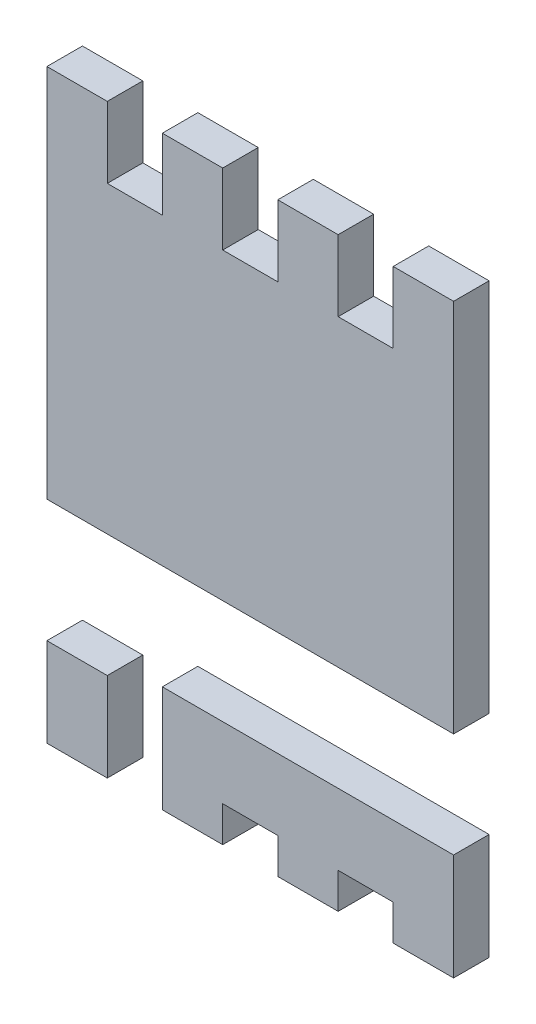
ISO-10303-21;
HEADER;
FILE_DESCRIPTION(('STEP AP214'),'2;1');
FILE_NAME('part.step','',(''),(''),'','','');
FILE_SCHEMA(('AUTOMOTIVE_DESIGN { 1 0 10303 214 1 1 1 1 }'));
ENDSEC;
DATA;
#1=APPLICATION_CONTEXT('core data for automotive mechanical design processes');
#2=APPLICATION_PROTOCOL_DEFINITION('international standard','automotive_design',2000,#1);
#3=PRODUCT_CONTEXT('',#1,'mechanical');
#4=PRODUCT('Part','Part','',(#3));
#5=PRODUCT_RELATED_PRODUCT_CATEGORY('part','',(#4));
#6=PRODUCT_DEFINITION_FORMATION('','',#4);
#7=PRODUCT_DEFINITION_CONTEXT('part definition',#1,'design');
#8=PRODUCT_DEFINITION('design','',#6,#7);
#9=PRODUCT_DEFINITION_SHAPE('','',#8);
#10=(LENGTH_UNIT() NAMED_UNIT(*) SI_UNIT(.MILLI.,.METRE.));
#11=(NAMED_UNIT(*) PLANE_ANGLE_UNIT() SI_UNIT($,.RADIAN.));
#12=(NAMED_UNIT(*) SI_UNIT($,.STERADIAN.) SOLID_ANGLE_UNIT());
#13=UNCERTAINTY_MEASURE_WITH_UNIT(LENGTH_MEASURE(1.E-05),#10,'distance_accuracy_value','');
#14=(GEOMETRIC_REPRESENTATION_CONTEXT(3) GLOBAL_UNCERTAINTY_ASSIGNED_CONTEXT((#13)) GLOBAL_UNIT_ASSIGNED_CONTEXT((#10,
#11,#12)) REPRESENTATION_CONTEXT('',''));
#15=CARTESIAN_POINT('',(0.,0.,0.));
#16=DIRECTION('',(0.,0.,1.));
#17=DIRECTION('',(1.,0.,0.));
#18=AXIS2_PLACEMENT_3D('',#15,#16,#17);
#19=CARTESIAN_POINT('',(-1.145,-1.65,0.2));
#20=DIRECTION('',(0.,1.,0.));
#21=DIRECTION('',(0.,0.,1.));
#22=AXIS2_PLACEMENT_3D('',#19,#20,#21);
#23=PLANE('',#22);
#24=DIRECTION('',(1.,0.,0.));
#25=VECTOR('',#24,1.);
#26=CARTESIAN_POINT('',(-1.145,-1.65,0.));
#27=LINE('',#26,#25);
#28=CARTESIAN_POINT('',(-1.145,-1.65,0.));
#29=VERTEX_POINT('',#28);
#30=CARTESIAN_POINT('',(-0.805,-1.65,0.));
#31=VERTEX_POINT('',#30);
#32=EDGE_CURVE('E112',#29,#31,#27,.T.);
#33=ORIENTED_EDGE('',*,*,#32,.T.);
#34=DIRECTION('',(0.,0.,-1.));
#35=VECTOR('',#34,1.);
#36=CARTESIAN_POINT('',(-0.805,-1.65,0.2));
#37=LINE('',#36,#35);
#38=CARTESIAN_POINT('',(-0.805,-1.65,0.2));
#39=VERTEX_POINT('',#38);
#40=EDGE_CURVE('E12',#39,#31,#37,.T.);
#41=ORIENTED_EDGE('',*,*,#40,.F.);
#42=DIRECTION('',(1.,0.,0.));
#43=VECTOR('',#42,1.);
#44=CARTESIAN_POINT('',(-1.145,-1.65,0.2));
#45=LINE('',#44,#43);
#46=CARTESIAN_POINT('',(-1.145,-1.65,0.2));
#47=VERTEX_POINT('',#46);
#48=EDGE_CURVE('E100',#47,#39,#45,.T.);
#49=ORIENTED_EDGE('',*,*,#48,.F.);
#50=DIRECTION('',(0.,0.,-1.));
#51=VECTOR('',#50,1.);
#52=CARTESIAN_POINT('',(-1.145,-1.65,0.2));
#53=LINE('',#52,#51);
#54=EDGE_CURVE('E108',#47,#29,#53,.T.);
#55=ORIENTED_EDGE('',*,*,#54,.T.);
#56=EDGE_LOOP('',(#33,#41,#49,#55));
#57=FACE_BOUND('',#56,.T.);
#58=ADVANCED_FACE('F49',(#57),#23,.F.);
#59=CARTESIAN_POINT('',(-0.805,-1.65,0.2));
#60=DIRECTION('',(-1.,0.,0.));
#61=DIRECTION('',(0.,0.,1.));
#62=AXIS2_PLACEMENT_3D('',#59,#60,#61);
#63=PLANE('',#62);
#64=DIRECTION('',(0.,1.,0.));
#65=VECTOR('',#64,1.);
#66=CARTESIAN_POINT('',(-0.805,-1.65,0.));
#67=LINE('',#66,#65);
#68=CARTESIAN_POINT('',(-0.805,-1.15,0.));
#69=VERTEX_POINT('',#68);
#70=EDGE_CURVE('E104',#31,#69,#67,.T.);
#71=ORIENTED_EDGE('',*,*,#70,.T.);
#72=DIRECTION('',(0.,0.,-1.));
#73=VECTOR('',#72,1.);
#74=CARTESIAN_POINT('',(-0.805,-1.15,0.2));
#75=LINE('',#74,#73);
#76=CARTESIAN_POINT('',(-0.805,-1.15,0.2));
#77=VERTEX_POINT('',#76);
#78=EDGE_CURVE('E57',#77,#69,#75,.T.);
#79=ORIENTED_EDGE('',*,*,#78,.F.);
#80=DIRECTION('',(0.,1.,0.));
#81=VECTOR('',#80,1.);
#82=CARTESIAN_POINT('',(-0.805,-1.65,0.2));
#83=LINE('',#82,#81);
#84=EDGE_CURVE('E95',#39,#77,#83,.T.);
#85=ORIENTED_EDGE('',*,*,#84,.F.);
#86=ORIENTED_EDGE('',*,*,#40,.T.);
#87=EDGE_LOOP('',(#71,#79,#85,#86));
#88=FACE_BOUND('',#87,.T.);
#89=ADVANCED_FACE('F103',(#88),#63,.F.);
#90=CARTESIAN_POINT('',(-0.805,-1.15,0.2));
#91=DIRECTION('',(0.,-1.,0.));
#92=DIRECTION('',(1.,0.,0.));
#93=AXIS2_PLACEMENT_3D('',#90,#91,#92);
#94=PLANE('',#93);
#95=DIRECTION('',(-1.,0.,0.));
#96=VECTOR('',#95,1.);
#97=CARTESIAN_POINT('',(-0.805,-1.15,0.));
#98=LINE('',#97,#96);
#99=CARTESIAN_POINT('',(-1.145,-1.15,0.));
#100=VERTEX_POINT('',#99);
#101=EDGE_CURVE('E82',#69,#100,#98,.T.);
#102=ORIENTED_EDGE('',*,*,#101,.T.);
#103=DIRECTION('',(0.,0.,-1.));
#104=VECTOR('',#103,1.);
#105=CARTESIAN_POINT('',(-1.145,-1.15,0.2));
#106=LINE('',#105,#104);
#107=CARTESIAN_POINT('',(-1.145,-1.15,0.2));
#108=VERTEX_POINT('',#107);
#109=EDGE_CURVE('E105',#108,#100,#106,.T.);
#110=ORIENTED_EDGE('',*,*,#109,.F.);
#111=DIRECTION('',(-1.,0.,0.));
#112=VECTOR('',#111,1.);
#113=CARTESIAN_POINT('',(-0.805,-1.15,0.2));
#114=LINE('',#113,#112);
#115=EDGE_CURVE('E98',#77,#108,#114,.T.);
#116=ORIENTED_EDGE('',*,*,#115,.F.);
#117=ORIENTED_EDGE('',*,*,#78,.T.);
#118=EDGE_LOOP('',(#102,#110,#116,#117));
#119=FACE_BOUND('',#118,.T.);
#120=ADVANCED_FACE('F106',(#119),#94,.F.);
#121=CARTESIAN_POINT('',(-1.145,-1.15,0.2));
#122=DIRECTION('',(1.,0.,0.));
#123=DIRECTION('',(0.,1.,0.));
#124=AXIS2_PLACEMENT_3D('',#121,#122,#123);
#125=PLANE('',#124);
#126=DIRECTION('',(0.,-1.,0.));
#127=VECTOR('',#126,1.);
#128=CARTESIAN_POINT('',(-1.145,-1.15,0.));
#129=LINE('',#128,#127);
#130=EDGE_CURVE('E88',#100,#29,#129,.T.);
#131=ORIENTED_EDGE('',*,*,#130,.T.);
#132=ORIENTED_EDGE('',*,*,#54,.F.);
#133=DIRECTION('',(0.,-1.,0.));
#134=VECTOR('',#133,1.);
#135=CARTESIAN_POINT('',(-1.145,-1.15,0.2));
#136=LINE('',#135,#134);
#137=EDGE_CURVE('E65',#108,#47,#136,.T.);
#138=ORIENTED_EDGE('',*,*,#137,.F.);
#139=ORIENTED_EDGE('',*,*,#109,.T.);
#140=EDGE_LOOP('',(#131,#132,#138,#139));
#141=FACE_BOUND('',#140,.T.);
#142=ADVANCED_FACE('F119',(#141),#125,.F.);
#143=CARTESIAN_POINT('',(0.,0.,0.2));
#144=DIRECTION('',(0.,0.,1.));
#145=DIRECTION('',(1.,0.,0.));
#146=AXIS2_PLACEMENT_3D('',#143,#144,#145);
#147=PLANE('',#146);
#148=ORIENTED_EDGE('',*,*,#48,.T.);
#149=ORIENTED_EDGE('',*,*,#84,.T.);
#150=ORIENTED_EDGE('',*,*,#115,.T.);
#151=ORIENTED_EDGE('',*,*,#137,.T.);
#152=EDGE_LOOP('',(#148,#149,#150,#151));
#153=FACE_BOUND('',#152,.T.);
#154=ADVANCED_FACE('F96',(#153),#147,.T.);
#155=CARTESIAN_POINT('',(0.,0.,0.));
#156=DIRECTION('',(0.,0.,1.));
#157=DIRECTION('',(1.,0.,0.));
#158=AXIS2_PLACEMENT_3D('',#155,#156,#157);
#159=PLANE('',#158);
#160=ORIENTED_EDGE('',*,*,#32,.F.);
#161=ORIENTED_EDGE('',*,*,#130,.F.);
#162=ORIENTED_EDGE('',*,*,#101,.F.);
#163=ORIENTED_EDGE('',*,*,#70,.F.);
#164=EDGE_LOOP('',(#160,#161,#162,#163));
#165=FACE_BOUND('',#164,.T.);
#166=ADVANCED_FACE('F122',(#165),#159,.F.);
#167=CLOSED_SHELL('',(#58,#89,#120,#142,#154,#166));
#168=MANIFOLD_SOLID_BREP('B2',#167);
#169=CARTESIAN_POINT('',(0.805,-1.65,0.2));
#170=DIRECTION('',(0.,1.,0.));
#171=DIRECTION('',(0.,0.,1.));
#172=AXIS2_PLACEMENT_3D('',#169,#170,#171);
#173=PLANE('',#172);
#174=DIRECTION('',(1.,0.,0.));
#175=VECTOR('',#174,1.);
#176=CARTESIAN_POINT('',(0.805,-1.65,0.));
#177=LINE('',#176,#175);
#178=CARTESIAN_POINT('',(0.805,-1.65,0.));
#179=VERTEX_POINT('',#178);
#180=CARTESIAN_POINT('',(1.145,-1.65,0.));
#181=VERTEX_POINT('',#180);
#182=EDGE_CURVE('E301',#179,#181,#177,.T.);
#183=ORIENTED_EDGE('',*,*,#182,.T.);
#184=DIRECTION('',(0.,0.,-1.));
#185=VECTOR('',#184,1.);
#186=CARTESIAN_POINT('',(1.145,-1.65,0.2));
#187=LINE('',#186,#185);
#188=CARTESIAN_POINT('',(1.145,-1.65,0.2));
#189=VERTEX_POINT('',#188);
#190=EDGE_CURVE('E47',#189,#181,#187,.T.);
#191=ORIENTED_EDGE('',*,*,#190,.F.);
#192=DIRECTION('',(1.,0.,0.));
#193=VECTOR('',#192,1.);
#194=CARTESIAN_POINT('',(0.805,-1.65,0.2));
#195=LINE('',#194,#193);
#196=CARTESIAN_POINT('',(0.805,-1.65,0.2));
#197=VERTEX_POINT('',#196);
#198=EDGE_CURVE('E323',#197,#189,#195,.T.);
#199=ORIENTED_EDGE('',*,*,#198,.F.);
#200=DIRECTION('',(0.,0.,-1.));
#201=VECTOR('',#200,1.);
#202=CARTESIAN_POINT('',(0.805,-1.65,0.2));
#203=LINE('',#202,#201);
#204=EDGE_CURVE('E297',#197,#179,#203,.T.);
#205=ORIENTED_EDGE('',*,*,#204,.T.);
#206=EDGE_LOOP('',(#183,#191,#199,#205));
#207=FACE_BOUND('',#206,.T.);
#208=ADVANCED_FACE('F181',(#207),#173,.F.);
#209=CARTESIAN_POINT('',(1.145,-1.65,0.2));
#210=DIRECTION('',(-1.,0.,0.));
#211=DIRECTION('',(0.,0.,1.));
#212=AXIS2_PLACEMENT_3D('',#209,#210,#211);
#213=PLANE('',#212);
#214=DIRECTION('',(0.,1.,0.));
#215=VECTOR('',#214,1.);
#216=CARTESIAN_POINT('',(1.145,-1.65,0.));
#217=LINE('',#216,#215);
#218=CARTESIAN_POINT('',(1.145,-1.05,0.));
#219=VERTEX_POINT('',#218);
#220=EDGE_CURVE('E304',#181,#219,#217,.T.);
#221=ORIENTED_EDGE('',*,*,#220,.T.);
#222=DIRECTION('',(0.,0.,-1.));
#223=VECTOR('',#222,1.);
#224=CARTESIAN_POINT('',(1.145,-1.05,0.2));
#225=LINE('',#224,#223);
#226=CARTESIAN_POINT('',(1.145,-1.05,0.2));
#227=VERTEX_POINT('',#226);
#228=EDGE_CURVE('E189',#227,#219,#225,.T.);
#229=ORIENTED_EDGE('',*,*,#228,.F.);
#230=DIRECTION('',(0.,1.,0.));
#231=VECTOR('',#230,1.);
#232=CARTESIAN_POINT('',(1.145,-1.65,0.2));
#233=LINE('',#232,#231);
#234=EDGE_CURVE('E252',#189,#227,#233,.T.);
#235=ORIENTED_EDGE('',*,*,#234,.F.);
#236=ORIENTED_EDGE('',*,*,#190,.T.);
#237=EDGE_LOOP('',(#221,#229,#235,#236));
#238=FACE_BOUND('',#237,.T.);
#239=ADVANCED_FACE('F401',(#238),#213,.F.);
#240=CARTESIAN_POINT('',(1.145,-1.05,0.2));
#241=DIRECTION('',(0.,-1.,0.));
#242=DIRECTION('',(1.,0.,0.));
#243=AXIS2_PLACEMENT_3D('',#240,#241,#242);
#244=PLANE('',#243);
#245=DIRECTION('',(-1.,0.,0.));
#246=VECTOR('',#245,1.);
#247=CARTESIAN_POINT('',(1.145,-1.05,0.));
#248=LINE('',#247,#246);
#249=CARTESIAN_POINT('',(-0.495,-1.05,0.));
#250=VERTEX_POINT('',#249);
#251=EDGE_CURVE('E306',#219,#250,#248,.T.);
#252=ORIENTED_EDGE('',*,*,#251,.T.);
#253=DIRECTION('',(0.,0.,-1.));
#254=VECTOR('',#253,1.);
#255=CARTESIAN_POINT('',(-0.495,-1.05,0.2));
#256=LINE('',#255,#254);
#257=CARTESIAN_POINT('',(-0.495,-1.05,0.2));
#258=VERTEX_POINT('',#257);
#259=EDGE_CURVE('E342',#258,#250,#256,.T.);
#260=ORIENTED_EDGE('',*,*,#259,.F.);
#261=DIRECTION('',(-1.,0.,0.));
#262=VECTOR('',#261,1.);
#263=CARTESIAN_POINT('',(1.145,-1.05,0.2));
#264=LINE('',#263,#262);
#265=EDGE_CURVE('E350',#227,#258,#264,.T.);
#266=ORIENTED_EDGE('',*,*,#265,.F.);
#267=ORIENTED_EDGE('',*,*,#228,.T.);
#268=EDGE_LOOP('',(#252,#260,#266,#267));
#269=FACE_BOUND('',#268,.T.);
#270=ADVANCED_FACE('F348',(#269),#244,.F.);
#271=CARTESIAN_POINT('',(-0.495,-1.05,0.2));
#272=DIRECTION('',(1.,0.,0.));
#273=DIRECTION('',(0.,0.,-1.));
#274=AXIS2_PLACEMENT_3D('',#271,#272,#273);
#275=PLANE('',#274);
#276=DIRECTION('',(0.,-1.,0.));
#277=VECTOR('',#276,1.);
#278=CARTESIAN_POINT('',(-0.495,-1.05,0.));
#279=LINE('',#278,#277);
#280=CARTESIAN_POINT('',(-0.495,-1.65,0.));
#281=VERTEX_POINT('',#280);
#282=EDGE_CURVE('E308',#250,#281,#279,.T.);
#283=ORIENTED_EDGE('',*,*,#282,.T.);
#284=DIRECTION('',(0.,0.,-1.));
#285=VECTOR('',#284,1.);
#286=CARTESIAN_POINT('',(-0.495,-1.65,0.2));
#287=LINE('',#286,#285);
#288=CARTESIAN_POINT('',(-0.495,-1.65,0.2));
#289=VERTEX_POINT('',#288);
#290=EDGE_CURVE('E339',#289,#281,#287,.T.);
#291=ORIENTED_EDGE('',*,*,#290,.F.);
#292=DIRECTION('',(0.,-1.,0.));
#293=VECTOR('',#292,1.);
#294=CARTESIAN_POINT('',(-0.495,-1.05,0.2));
#295=LINE('',#294,#293);
#296=EDGE_CURVE('E368',#258,#289,#295,.T.);
#297=ORIENTED_EDGE('',*,*,#296,.F.);
#298=ORIENTED_EDGE('',*,*,#259,.T.);
#299=EDGE_LOOP('',(#283,#291,#297,#298));
#300=FACE_BOUND('',#299,.T.);
#301=ADVANCED_FACE('F359',(#300),#275,.F.);
#302=CARTESIAN_POINT('',(-0.495,-1.65,0.2));
#303=DIRECTION('',(0.,1.,0.));
#304=DIRECTION('',(0.,0.,1.));
#305=AXIS2_PLACEMENT_3D('',#302,#303,#304);
#306=PLANE('',#305);
#307=DIRECTION('',(1.,0.,0.));
#308=VECTOR('',#307,1.);
#309=CARTESIAN_POINT('',(-0.495,-1.65,0.));
#310=LINE('',#309,#308);
#311=CARTESIAN_POINT('',(-0.155,-1.65,0.));
#312=VERTEX_POINT('',#311);
#313=EDGE_CURVE('E310',#281,#312,#310,.T.);
#314=ORIENTED_EDGE('',*,*,#313,.T.);
#315=DIRECTION('',(0.,0.,-1.));
#316=VECTOR('',#315,1.);
#317=CARTESIAN_POINT('',(-0.155,-1.65,0.2));
#318=LINE('',#317,#316);
#319=CARTESIAN_POINT('',(-0.155,-1.65,0.2));
#320=VERTEX_POINT('',#319);
#321=EDGE_CURVE('E336',#320,#312,#318,.T.);
#322=ORIENTED_EDGE('',*,*,#321,.F.);
#323=DIRECTION('',(1.,0.,0.));
#324=VECTOR('',#323,1.);
#325=CARTESIAN_POINT('',(-0.495,-1.65,0.2));
#326=LINE('',#325,#324);
#327=EDGE_CURVE('E365',#289,#320,#326,.T.);
#328=ORIENTED_EDGE('',*,*,#327,.F.);
#329=ORIENTED_EDGE('',*,*,#290,.T.);
#330=EDGE_LOOP('',(#314,#322,#328,#329));
#331=FACE_BOUND('',#330,.T.);
#332=ADVANCED_FACE('F363',(#331),#306,.F.);
#333=CARTESIAN_POINT('',(-0.155,-1.65,0.2));
#334=DIRECTION('',(-1.,0.,0.));
#335=DIRECTION('',(0.,0.,1.));
#336=AXIS2_PLACEMENT_3D('',#333,#334,#335);
#337=PLANE('',#336);
#338=DIRECTION('',(0.,1.,0.));
#339=VECTOR('',#338,1.);
#340=CARTESIAN_POINT('',(-0.155,-1.65,0.));
#341=LINE('',#340,#339);
#342=CARTESIAN_POINT('',(-0.155,-1.45,0.));
#343=VERTEX_POINT('',#342);
#344=EDGE_CURVE('E312',#312,#343,#341,.T.);
#345=ORIENTED_EDGE('',*,*,#344,.T.);
#346=DIRECTION('',(0.,0.,-1.));
#347=VECTOR('',#346,1.);
#348=CARTESIAN_POINT('',(-0.155,-1.45,0.2));
#349=LINE('',#348,#347);
#350=CARTESIAN_POINT('',(-0.155,-1.45,0.2));
#351=VERTEX_POINT('',#350);
#352=EDGE_CURVE('E333',#351,#343,#349,.T.);
#353=ORIENTED_EDGE('',*,*,#352,.F.);
#354=DIRECTION('',(0.,1.,0.));
#355=VECTOR('',#354,1.);
#356=CARTESIAN_POINT('',(-0.155,-1.65,0.2));
#357=LINE('',#356,#355);
#358=EDGE_CURVE('E367',#320,#351,#357,.T.);
#359=ORIENTED_EDGE('',*,*,#358,.F.);
#360=ORIENTED_EDGE('',*,*,#321,.T.);
#361=EDGE_LOOP('',(#345,#353,#359,#360));
#362=FACE_BOUND('',#361,.T.);
#363=ADVANCED_FACE('F414',(#362),#337,.F.);
#364=CARTESIAN_POINT('',(-0.155,-1.45,0.2));
#365=DIRECTION('',(0.,1.,0.));
#366=DIRECTION('',(0.,0.,1.));
#367=AXIS2_PLACEMENT_3D('',#364,#365,#366);
#368=PLANE('',#367);
#369=DIRECTION('',(1.,0.,0.));
#370=VECTOR('',#369,1.);
#371=CARTESIAN_POINT('',(-0.155,-1.45,0.));
#372=LINE('',#371,#370);
#373=CARTESIAN_POINT('',(0.155,-1.45,0.));
#374=VERTEX_POINT('',#373);
#375=EDGE_CURVE('E314',#343,#374,#372,.T.);
#376=ORIENTED_EDGE('',*,*,#375,.T.);
#377=DIRECTION('',(0.,0.,-1.));
#378=VECTOR('',#377,1.);
#379=CARTESIAN_POINT('',(0.155,-1.45,0.2));
#380=LINE('',#379,#378);
#381=CARTESIAN_POINT('',(0.155,-1.45,0.2));
#382=VERTEX_POINT('',#381);
#383=EDGE_CURVE('E330',#382,#374,#380,.T.);
#384=ORIENTED_EDGE('',*,*,#383,.F.);
#385=DIRECTION('',(1.,0.,0.));
#386=VECTOR('',#385,1.);
#387=CARTESIAN_POINT('',(-0.155,-1.45,0.2));
#388=LINE('',#387,#386);
#389=EDGE_CURVE('E370',#351,#382,#388,.T.);
#390=ORIENTED_EDGE('',*,*,#389,.F.);
#391=ORIENTED_EDGE('',*,*,#352,.T.);
#392=EDGE_LOOP('',(#376,#384,#390,#391));
#393=FACE_BOUND('',#392,.T.);
#394=ADVANCED_FACE('F417',(#393),#368,.F.);
#395=CARTESIAN_POINT('',(0.155,-1.45,0.2));
#396=DIRECTION('',(1.,0.,0.));
#397=DIRECTION('',(0.,1.,0.));
#398=AXIS2_PLACEMENT_3D('',#395,#396,#397);
#399=PLANE('',#398);
#400=DIRECTION('',(0.,-1.,0.));
#401=VECTOR('',#400,1.);
#402=CARTESIAN_POINT('',(0.155,-1.45,0.));
#403=LINE('',#402,#401);
#404=CARTESIAN_POINT('',(0.155,-1.65,0.));
#405=VERTEX_POINT('',#404);
#406=EDGE_CURVE('E316',#374,#405,#403,.T.);
#407=ORIENTED_EDGE('',*,*,#406,.T.);
#408=DIRECTION('',(0.,0.,-1.));
#409=VECTOR('',#408,1.);
#410=CARTESIAN_POINT('',(0.155,-1.65,0.2));
#411=LINE('',#410,#409);
#412=CARTESIAN_POINT('',(0.155,-1.65,0.2));
#413=VERTEX_POINT('',#412);
#414=EDGE_CURVE('E327',#413,#405,#411,.T.);
#415=ORIENTED_EDGE('',*,*,#414,.F.);
#416=DIRECTION('',(0.,-1.,0.));
#417=VECTOR('',#416,1.);
#418=CARTESIAN_POINT('',(0.155,-1.45,0.2));
#419=LINE('',#418,#417);
#420=EDGE_CURVE('E376',#382,#413,#419,.T.);
#421=ORIENTED_EDGE('',*,*,#420,.F.);
#422=ORIENTED_EDGE('',*,*,#383,.T.);
#423=EDGE_LOOP('',(#407,#415,#421,#422));
#424=FACE_BOUND('',#423,.T.);
#425=ADVANCED_FACE('F382',(#424),#399,.F.);
#426=CARTESIAN_POINT('',(0.155,-1.65,0.2));
#427=DIRECTION('',(0.,1.,0.));
#428=DIRECTION('',(0.,0.,1.));
#429=AXIS2_PLACEMENT_3D('',#426,#427,#428);
#430=PLANE('',#429);
#431=DIRECTION('',(1.,0.,0.));
#432=VECTOR('',#431,1.);
#433=CARTESIAN_POINT('',(0.155,-1.65,0.));
#434=LINE('',#433,#432);
#435=CARTESIAN_POINT('',(0.495,-1.65,0.));
#436=VERTEX_POINT('',#435);
#437=EDGE_CURVE('E318',#405,#436,#434,.T.);
#438=ORIENTED_EDGE('',*,*,#437,.T.);
#439=DIRECTION('',(0.,0.,-1.));
#440=VECTOR('',#439,1.);
#441=CARTESIAN_POINT('',(0.495,-1.65,0.2));
#442=LINE('',#441,#440);
#443=CARTESIAN_POINT('',(0.495,-1.65,0.2));
#444=VERTEX_POINT('',#443);
#445=EDGE_CURVE('E292',#444,#436,#442,.T.);
#446=ORIENTED_EDGE('',*,*,#445,.F.);
#447=DIRECTION('',(1.,0.,0.));
#448=VECTOR('',#447,1.);
#449=CARTESIAN_POINT('',(0.155,-1.65,0.2));
#450=LINE('',#449,#448);
#451=EDGE_CURVE('E283',#413,#444,#450,.T.);
#452=ORIENTED_EDGE('',*,*,#451,.F.);
#453=ORIENTED_EDGE('',*,*,#414,.T.);
#454=EDGE_LOOP('',(#438,#446,#452,#453));
#455=FACE_BOUND('',#454,.T.);
#456=ADVANCED_FACE('F386',(#455),#430,.F.);
#457=CARTESIAN_POINT('',(0.495,-1.65,0.2));
#458=DIRECTION('',(-1.,0.,0.));
#459=DIRECTION('',(0.,0.,1.));
#460=AXIS2_PLACEMENT_3D('',#457,#458,#459);
#461=PLANE('',#460);
#462=DIRECTION('',(0.,1.,0.));
#463=VECTOR('',#462,1.);
#464=CARTESIAN_POINT('',(0.495,-1.65,0.));
#465=LINE('',#464,#463);
#466=CARTESIAN_POINT('',(0.495,-1.45,0.));
#467=VERTEX_POINT('',#466);
#468=EDGE_CURVE('E291',#436,#467,#465,.T.);
#469=ORIENTED_EDGE('',*,*,#468,.T.);
#470=DIRECTION('',(0.,0.,-1.));
#471=VECTOR('',#470,1.);
#472=CARTESIAN_POINT('',(0.495,-1.45,0.2));
#473=LINE('',#472,#471);
#474=CARTESIAN_POINT('',(0.495,-1.45,0.2));
#475=VERTEX_POINT('',#474);
#476=EDGE_CURVE('E288',#475,#467,#473,.T.);
#477=ORIENTED_EDGE('',*,*,#476,.F.);
#478=DIRECTION('',(0.,1.,0.));
#479=VECTOR('',#478,1.);
#480=CARTESIAN_POINT('',(0.495,-1.65,0.2));
#481=LINE('',#480,#479);
#482=EDGE_CURVE('E277',#444,#475,#481,.T.);
#483=ORIENTED_EDGE('',*,*,#482,.F.);
#484=ORIENTED_EDGE('',*,*,#445,.T.);
#485=EDGE_LOOP('',(#469,#477,#483,#484));
#486=FACE_BOUND('',#485,.T.);
#487=ADVANCED_FACE('F289',(#486),#461,.F.);
#488=CARTESIAN_POINT('',(0.495,-1.45,0.2));
#489=DIRECTION('',(0.,1.,0.));
#490=DIRECTION('',(0.,0.,1.));
#491=AXIS2_PLACEMENT_3D('',#488,#489,#490);
#492=PLANE('',#491);
#493=DIRECTION('',(1.,0.,0.));
#494=VECTOR('',#493,1.);
#495=CARTESIAN_POINT('',(0.495,-1.45,0.));
#496=LINE('',#495,#494);
#497=CARTESIAN_POINT('',(0.805,-1.45,0.));
#498=VERTEX_POINT('',#497);
#499=EDGE_CURVE('E238',#467,#498,#496,.T.);
#500=ORIENTED_EDGE('',*,*,#499,.T.);
#501=DIRECTION('',(0.,0.,-1.));
#502=VECTOR('',#501,1.);
#503=CARTESIAN_POINT('',(0.805,-1.45,0.2));
#504=LINE('',#503,#502);
#505=CARTESIAN_POINT('',(0.805,-1.45,0.2));
#506=VERTEX_POINT('',#505);
#507=EDGE_CURVE('E293',#506,#498,#504,.T.);
#508=ORIENTED_EDGE('',*,*,#507,.F.);
#509=DIRECTION('',(1.,0.,0.));
#510=VECTOR('',#509,1.);
#511=CARTESIAN_POINT('',(0.495,-1.45,0.2));
#512=LINE('',#511,#510);
#513=EDGE_CURVE('E281',#475,#506,#512,.T.);
#514=ORIENTED_EDGE('',*,*,#513,.F.);
#515=ORIENTED_EDGE('',*,*,#476,.T.);
#516=EDGE_LOOP('',(#500,#508,#514,#515));
#517=FACE_BOUND('',#516,.T.);
#518=ADVANCED_FACE('F295',(#517),#492,.F.);
#519=CARTESIAN_POINT('',(0.805,-1.45,0.2));
#520=DIRECTION('',(1.,0.,0.));
#521=DIRECTION('',(0.,0.,-1.));
#522=AXIS2_PLACEMENT_3D('',#519,#520,#521);
#523=PLANE('',#522);
#524=DIRECTION('',(0.,-1.,0.));
#525=VECTOR('',#524,1.);
#526=CARTESIAN_POINT('',(0.805,-1.45,0.));
#527=LINE('',#526,#525);
#528=EDGE_CURVE('E244',#498,#179,#527,.T.);
#529=ORIENTED_EDGE('',*,*,#528,.T.);
#530=ORIENTED_EDGE('',*,*,#204,.F.);
#531=DIRECTION('',(0.,-1.,0.));
#532=VECTOR('',#531,1.);
#533=CARTESIAN_POINT('',(0.805,-1.45,0.2));
#534=LINE('',#533,#532);
#535=EDGE_CURVE('E197',#506,#197,#534,.T.);
#536=ORIENTED_EDGE('',*,*,#535,.F.);
#537=ORIENTED_EDGE('',*,*,#507,.T.);
#538=EDGE_LOOP('',(#529,#530,#536,#537));
#539=FACE_BOUND('',#538,.T.);
#540=ADVANCED_FACE('F390',(#539),#523,.F.);
#541=CARTESIAN_POINT('',(0.,0.,0.2));
#542=DIRECTION('',(0.,0.,1.));
#543=DIRECTION('',(1.,0.,0.));
#544=AXIS2_PLACEMENT_3D('',#541,#542,#543);
#545=PLANE('',#544);
#546=ORIENTED_EDGE('',*,*,#198,.T.);
#547=ORIENTED_EDGE('',*,*,#234,.T.);
#548=ORIENTED_EDGE('',*,*,#265,.T.);
#549=ORIENTED_EDGE('',*,*,#296,.T.);
#550=ORIENTED_EDGE('',*,*,#327,.T.);
#551=ORIENTED_EDGE('',*,*,#358,.T.);
#552=ORIENTED_EDGE('',*,*,#389,.T.);
#553=ORIENTED_EDGE('',*,*,#420,.T.);
#554=ORIENTED_EDGE('',*,*,#451,.T.);
#555=ORIENTED_EDGE('',*,*,#482,.T.);
#556=ORIENTED_EDGE('',*,*,#513,.T.);
#557=ORIENTED_EDGE('',*,*,#535,.T.);
#558=EDGE_LOOP('',(#546,#547,#548,#549,#550,#551,#552,#553,#554,#555,#556,#557));
#559=FACE_BOUND('',#558,.T.);
#560=ADVANCED_FACE('F279',(#559),#545,.T.);
#561=CARTESIAN_POINT('',(0.,0.,0.));
#562=DIRECTION('',(0.,0.,1.));
#563=DIRECTION('',(1.,0.,0.));
#564=AXIS2_PLACEMENT_3D('',#561,#562,#563);
#565=PLANE('',#564);
#566=ORIENTED_EDGE('',*,*,#182,.F.);
#567=ORIENTED_EDGE('',*,*,#528,.F.);
#568=ORIENTED_EDGE('',*,*,#499,.F.);
#569=ORIENTED_EDGE('',*,*,#468,.F.);
#570=ORIENTED_EDGE('',*,*,#437,.F.);
#571=ORIENTED_EDGE('',*,*,#406,.F.);
#572=ORIENTED_EDGE('',*,*,#375,.F.);
#573=ORIENTED_EDGE('',*,*,#344,.F.);
#574=ORIENTED_EDGE('',*,*,#313,.F.);
#575=ORIENTED_EDGE('',*,*,#282,.F.);
#576=ORIENTED_EDGE('',*,*,#251,.F.);
#577=ORIENTED_EDGE('',*,*,#220,.F.);
#578=EDGE_LOOP('',(#566,#567,#568,#569,#570,#571,#572,#573,#574,#575,#576,#577));
#579=FACE_BOUND('',#578,.T.);
#580=ADVANCED_FACE('F354',(#579),#565,.F.);
#581=CLOSED_SHELL('',(#208,#239,#270,#301,#332,#363,#394,#425,#456,#487,#518,#540,#560,#580));
#582=MANIFOLD_SOLID_BREP('B6',#581);
#583=CARTESIAN_POINT('',(-0.805,1.65,0.2));
#584=DIRECTION('',(0.,-1.,0.));
#585=DIRECTION('',(0.,0.,-1.));
#586=AXIS2_PLACEMENT_3D('',#583,#584,#585);
#587=PLANE('',#586);
#588=DIRECTION('',(-1.,0.,0.));
#589=VECTOR('',#588,1.);
#590=CARTESIAN_POINT('',(-0.805,1.65,0.));
#591=LINE('',#590,#589);
#592=CARTESIAN_POINT('',(-0.805,1.65,0.));
#593=VERTEX_POINT('',#592);
#594=CARTESIAN_POINT('',(-1.145,1.65,0.));
#595=VERTEX_POINT('',#594);
#596=EDGE_CURVE('E661',#593,#595,#591,.T.);
#597=ORIENTED_EDGE('',*,*,#596,.T.);
#598=DIRECTION('',(0.,0.,-1.));
#599=VECTOR('',#598,1.);
#600=CARTESIAN_POINT('',(-1.145,1.65,0.2));
#601=LINE('',#600,#599);
#602=CARTESIAN_POINT('',(-1.145,1.65,0.2));
#603=VERTEX_POINT('',#602);
#604=EDGE_CURVE('E179',#603,#595,#601,.T.);
#605=ORIENTED_EDGE('',*,*,#604,.F.);
#606=DIRECTION('',(-1.,0.,0.));
#607=VECTOR('',#606,1.);
#608=CARTESIAN_POINT('',(-0.805,1.65,0.2));
#609=LINE('',#608,#607);
#610=CARTESIAN_POINT('',(-0.805,1.65,0.2));
#611=VERTEX_POINT('',#610);
#612=EDGE_CURVE('E707',#611,#603,#609,.T.);
#613=ORIENTED_EDGE('',*,*,#612,.F.);
#614=DIRECTION('',(0.,0.,-1.));
#615=VECTOR('',#614,1.);
#616=CARTESIAN_POINT('',(-0.805,1.65,0.2));
#617=LINE('',#616,#615);
#618=EDGE_CURVE('E657',#611,#593,#617,.T.);
#619=ORIENTED_EDGE('',*,*,#618,.T.);
#620=EDGE_LOOP('',(#597,#605,#613,#619));
#621=FACE_BOUND('',#620,.T.);
#622=ADVANCED_FACE('F512',(#621),#587,.F.);
#623=CARTESIAN_POINT('',(-1.145,1.65,0.2));
#624=DIRECTION('',(1.,0.,0.));
#625=DIRECTION('',(0.,1.,0.));
#626=AXIS2_PLACEMENT_3D('',#623,#624,#625);
#627=PLANE('',#626);
#628=DIRECTION('',(0.,-1.,0.));
#629=VECTOR('',#628,1.);
#630=CARTESIAN_POINT('',(-1.145,1.65,0.));
#631=LINE('',#630,#629);
#632=CARTESIAN_POINT('',(-1.145,-0.46,0.));
#633=VERTEX_POINT('',#632);
#634=EDGE_CURVE('E665',#595,#633,#631,.T.);
#635=ORIENTED_EDGE('',*,*,#634,.T.);
#636=DIRECTION('',(0.,0.,-1.));
#637=VECTOR('',#636,1.);
#638=CARTESIAN_POINT('',(-1.145,-0.46,0.2));
#639=LINE('',#638,#637);
#640=CARTESIAN_POINT('',(-1.145,-0.46,0.2));
#641=VERTEX_POINT('',#640);
#642=EDGE_CURVE('E521',#641,#633,#639,.T.);
#643=ORIENTED_EDGE('',*,*,#642,.F.);
#644=DIRECTION('',(0.,-1.,0.));
#645=VECTOR('',#644,1.);
#646=CARTESIAN_POINT('',(-1.145,1.65,0.2));
#647=LINE('',#646,#645);
#648=EDGE_CURVE('E596',#603,#641,#647,.T.);
#649=ORIENTED_EDGE('',*,*,#648,.F.);
#650=ORIENTED_EDGE('',*,*,#604,.T.);
#651=EDGE_LOOP('',(#635,#643,#649,#650));
#652=FACE_BOUND('',#651,.T.);
#653=ADVANCED_FACE('F829',(#652),#627,.F.);
#654=CARTESIAN_POINT('',(-1.145,-0.46,0.2));
#655=DIRECTION('',(0.,1.,0.));
#656=DIRECTION('',(0.,0.,1.));
#657=AXIS2_PLACEMENT_3D('',#654,#655,#656);
#658=PLANE('',#657);
#659=DIRECTION('',(1.,0.,0.));
#660=VECTOR('',#659,1.);
#661=CARTESIAN_POINT('',(-1.145,-0.46,0.));
#662=LINE('',#661,#660);
#663=CARTESIAN_POINT('',(1.145,-0.46,0.));
#664=VERTEX_POINT('',#663);
#665=EDGE_CURVE('E668',#633,#664,#662,.T.);
#666=ORIENTED_EDGE('',*,*,#665,.T.);
#667=DIRECTION('',(0.,0.,-1.));
#668=VECTOR('',#667,1.);
#669=CARTESIAN_POINT('',(1.145,-0.46,0.2));
#670=LINE('',#669,#668);
#671=CARTESIAN_POINT('',(1.145,-0.46,0.2));
#672=VERTEX_POINT('',#671);
#673=EDGE_CURVE('E750',#672,#664,#670,.T.);
#674=ORIENTED_EDGE('',*,*,#673,.F.);
#675=DIRECTION('',(1.,0.,0.));
#676=VECTOR('',#675,1.);
#677=CARTESIAN_POINT('',(-1.145,-0.46,0.2));
#678=LINE('',#677,#676);
#679=EDGE_CURVE('E760',#641,#672,#678,.T.);
#680=ORIENTED_EDGE('',*,*,#679,.F.);
#681=ORIENTED_EDGE('',*,*,#642,.T.);
#682=EDGE_LOOP('',(#666,#674,#680,#681));
#683=FACE_BOUND('',#682,.T.);
#684=ADVANCED_FACE('F758',(#683),#658,.F.);
#685=CARTESIAN_POINT('',(1.145,-0.46,0.2));
#686=DIRECTION('',(-1.,0.,0.));
#687=DIRECTION('',(0.,0.,1.));
#688=AXIS2_PLACEMENT_3D('',#685,#686,#687);
#689=PLANE('',#688);
#690=DIRECTION('',(0.,1.,0.));
#691=VECTOR('',#690,1.);
#692=CARTESIAN_POINT('',(1.145,-0.46,0.));
#693=LINE('',#692,#691);
#694=CARTESIAN_POINT('',(1.145,1.65,0.));
#695=VERTEX_POINT('',#694);
#696=EDGE_CURVE('E671',#664,#695,#693,.T.);
#697=ORIENTED_EDGE('',*,*,#696,.T.);
#698=DIRECTION('',(0.,0.,-1.));
#699=VECTOR('',#698,1.);
#700=CARTESIAN_POINT('',(1.145,1.65,0.2));
#701=LINE('',#700,#699);
#702=CARTESIAN_POINT('',(1.145,1.65,0.2));
#703=VERTEX_POINT('',#702);
#704=EDGE_CURVE('E746',#703,#695,#701,.T.);
#705=ORIENTED_EDGE('',*,*,#704,.F.);
#706=DIRECTION('',(0.,1.,0.));
#707=VECTOR('',#706,1.);
#708=CARTESIAN_POINT('',(1.145,-0.46,0.2));
#709=LINE('',#708,#707);
#710=EDGE_CURVE('E779',#672,#703,#709,.T.);
#711=ORIENTED_EDGE('',*,*,#710,.F.);
#712=ORIENTED_EDGE('',*,*,#673,.T.);
#713=EDGE_LOOP('',(#697,#705,#711,#712));
#714=FACE_BOUND('',#713,.T.);
#715=ADVANCED_FACE('F769',(#714),#689,.F.);
#716=CARTESIAN_POINT('',(1.145,1.65,0.2));
#717=DIRECTION('',(0.,-1.,0.));
#718=DIRECTION('',(0.,0.,-1.));
#719=AXIS2_PLACEMENT_3D('',#716,#717,#718);
#720=PLANE('',#719);
#721=DIRECTION('',(-1.,0.,0.));
#722=VECTOR('',#721,1.);
#723=CARTESIAN_POINT('',(1.145,1.65,0.));
#724=LINE('',#723,#722);
#725=CARTESIAN_POINT('',(0.805,1.65,0.));
#726=VERTEX_POINT('',#725);
#727=EDGE_CURVE('E674',#695,#726,#724,.T.);
#728=ORIENTED_EDGE('',*,*,#727,.T.);
#729=DIRECTION('',(0.,0.,-1.));
#730=VECTOR('',#729,1.);
#731=CARTESIAN_POINT('',(0.805,1.65,0.2));
#732=LINE('',#731,#730);
#733=CARTESIAN_POINT('',(0.805,1.65,0.2));
#734=VERTEX_POINT('',#733);
#735=EDGE_CURVE('E742',#734,#726,#732,.T.);
#736=ORIENTED_EDGE('',*,*,#735,.F.);
#737=DIRECTION('',(-1.,0.,0.));
#738=VECTOR('',#737,1.);
#739=CARTESIAN_POINT('',(1.145,1.65,0.2));
#740=LINE('',#739,#738);
#741=EDGE_CURVE('E775',#703,#734,#740,.T.);
#742=ORIENTED_EDGE('',*,*,#741,.F.);
#743=ORIENTED_EDGE('',*,*,#704,.T.);
#744=EDGE_LOOP('',(#728,#736,#742,#743));
#745=FACE_BOUND('',#744,.T.);
#746=ADVANCED_FACE('F773',(#745),#720,.F.);
#747=CARTESIAN_POINT('',(0.805,1.65,0.2));
#748=DIRECTION('',(1.,0.,0.));
#749=DIRECTION('',(0.,0.,-1.));
#750=AXIS2_PLACEMENT_3D('',#747,#748,#749);
#751=PLANE('',#750);
#752=DIRECTION('',(0.,-1.,0.));
#753=VECTOR('',#752,1.);
#754=CARTESIAN_POINT('',(0.805,1.65,0.));
#755=LINE('',#754,#753);
#756=CARTESIAN_POINT('',(0.805,1.25,0.));
#757=VERTEX_POINT('',#756);
#758=EDGE_CURVE('E677',#726,#757,#755,.T.);
#759=ORIENTED_EDGE('',*,*,#758,.T.);
#760=DIRECTION('',(0.,0.,-1.));
#761=VECTOR('',#760,1.);
#762=CARTESIAN_POINT('',(0.805,1.25,0.2));
#763=LINE('',#762,#761);
#764=CARTESIAN_POINT('',(0.805,1.25,0.2));
#765=VERTEX_POINT('',#764);
#766=EDGE_CURVE('E738',#765,#757,#763,.T.);
#767=ORIENTED_EDGE('',*,*,#766,.F.);
#768=DIRECTION('',(0.,-1.,0.));
#769=VECTOR('',#768,1.);
#770=CARTESIAN_POINT('',(0.805,1.65,0.2));
#771=LINE('',#770,#769);
#772=EDGE_CURVE('E778',#734,#765,#771,.T.);
#773=ORIENTED_EDGE('',*,*,#772,.F.);
#774=ORIENTED_EDGE('',*,*,#735,.T.);
#775=EDGE_LOOP('',(#759,#767,#773,#774));
#776=FACE_BOUND('',#775,.T.);
#777=ADVANCED_FACE('F842',(#776),#751,.F.);
#778=CARTESIAN_POINT('',(0.805,1.25,0.2));
#779=DIRECTION('',(0.,-1.,0.));
#780=DIRECTION('',(0.,0.,-1.));
#781=AXIS2_PLACEMENT_3D('',#778,#779,#780);
#782=PLANE('',#781);
#783=DIRECTION('',(-1.,0.,0.));
#784=VECTOR('',#783,1.);
#785=CARTESIAN_POINT('',(0.805,1.25,0.));
#786=LINE('',#785,#784);
#787=CARTESIAN_POINT('',(0.495,1.25,0.));
#788=VERTEX_POINT('',#787);
#789=EDGE_CURVE('E680',#757,#788,#786,.T.);
#790=ORIENTED_EDGE('',*,*,#789,.T.);
#791=DIRECTION('',(0.,0.,-1.));
#792=VECTOR('',#791,1.);
#793=CARTESIAN_POINT('',(0.495,1.25,0.2));
#794=LINE('',#793,#792);
#795=CARTESIAN_POINT('',(0.495,1.25,0.2));
#796=VERTEX_POINT('',#795);
#797=EDGE_CURVE('E734',#796,#788,#794,.T.);
#798=ORIENTED_EDGE('',*,*,#797,.F.);
#799=DIRECTION('',(-1.,0.,0.));
#800=VECTOR('',#799,1.);
#801=CARTESIAN_POINT('',(0.805,1.25,0.2));
#802=LINE('',#801,#800);
#803=EDGE_CURVE('E783',#765,#796,#802,.T.);
#804=ORIENTED_EDGE('',*,*,#803,.F.);
#805=ORIENTED_EDGE('',*,*,#766,.T.);
#806=EDGE_LOOP('',(#790,#798,#804,#805));
#807=FACE_BOUND('',#806,.T.);
#808=ADVANCED_FACE('F845',(#807),#782,.F.);
#809=CARTESIAN_POINT('',(0.495,1.25,0.2));
#810=DIRECTION('',(-1.,0.,0.));
#811=DIRECTION('',(0.,0.,1.));
#812=AXIS2_PLACEMENT_3D('',#809,#810,#811);
#813=PLANE('',#812);
#814=DIRECTION('',(0.,1.,0.));
#815=VECTOR('',#814,1.);
#816=CARTESIAN_POINT('',(0.495,1.25,0.));
#817=LINE('',#816,#815);
#818=CARTESIAN_POINT('',(0.495,1.65,0.));
#819=VERTEX_POINT('',#818);
#820=EDGE_CURVE('E683',#788,#819,#817,.T.);
#821=ORIENTED_EDGE('',*,*,#820,.T.);
#822=DIRECTION('',(0.,0.,-1.));
#823=VECTOR('',#822,1.);
#824=CARTESIAN_POINT('',(0.495,1.65,0.2));
#825=LINE('',#824,#823);
#826=CARTESIAN_POINT('',(0.495,1.65,0.2));
#827=VERTEX_POINT('',#826);
#828=EDGE_CURVE('E730',#827,#819,#825,.T.);
#829=ORIENTED_EDGE('',*,*,#828,.F.);
#830=DIRECTION('',(0.,1.,0.));
#831=VECTOR('',#830,1.);
#832=CARTESIAN_POINT('',(0.495,1.25,0.2));
#833=LINE('',#832,#831);
#834=EDGE_CURVE('E790',#796,#827,#833,.T.);
#835=ORIENTED_EDGE('',*,*,#834,.F.);
#836=ORIENTED_EDGE('',*,*,#797,.T.);
#837=EDGE_LOOP('',(#821,#829,#835,#836));
#838=FACE_BOUND('',#837,.T.);
#839=ADVANCED_FACE('F849',(#838),#813,.F.);
#840=CARTESIAN_POINT('',(0.155,1.65,0.2));
#841=DIRECTION('',(0.,-1.,0.));
#842=DIRECTION('',(0.,0.,-1.));
#843=AXIS2_PLACEMENT_3D('',#840,#841,#842);
#844=PLANE('',#843);
#845=DIRECTION('',(-1.,0.,0.));
#846=VECTOR('',#845,1.);
#847=CARTESIAN_POINT('',(0.155,1.65,0.));
#848=LINE('',#847,#846);
#849=CARTESIAN_POINT('',(0.155,1.65,0.));
#850=VERTEX_POINT('',#849);
#851=EDGE_CURVE('E686',#819,#850,#848,.T.);
#852=ORIENTED_EDGE('',*,*,#851,.T.);
#853=DIRECTION('',(0.,0.,-1.));
#854=VECTOR('',#853,1.);
#855=CARTESIAN_POINT('',(0.155,1.65,0.2));
#856=LINE('',#855,#854);
#857=CARTESIAN_POINT('',(0.155,1.65,0.2));
#858=VERTEX_POINT('',#857);
#859=EDGE_CURVE('E726',#858,#850,#856,.T.);
#860=ORIENTED_EDGE('',*,*,#859,.F.);
#861=DIRECTION('',(-1.,0.,0.));
#862=VECTOR('',#861,1.);
#863=CARTESIAN_POINT('',(0.155,1.65,0.2));
#864=LINE('',#863,#862);
#865=EDGE_CURVE('E793',#827,#858,#864,.T.);
#866=ORIENTED_EDGE('',*,*,#865,.F.);
#867=ORIENTED_EDGE('',*,*,#828,.T.);
#868=EDGE_LOOP('',(#852,#860,#866,#867));
#869=FACE_BOUND('',#868,.T.);
#870=ADVANCED_FACE('F853',(#869),#844,.F.);
#871=CARTESIAN_POINT('',(0.155,1.25,0.2));
#872=DIRECTION('',(1.,0.,0.));
#873=DIRECTION('',(0.,0.,-1.));
#874=AXIS2_PLACEMENT_3D('',#871,#872,#873);
#875=PLANE('',#874);
#876=DIRECTION('',(0.,-1.,0.));
#877=VECTOR('',#876,1.);
#878=CARTESIAN_POINT('',(0.155,1.25,0.));
#879=LINE('',#878,#877);
#880=CARTESIAN_POINT('',(0.155,1.25,0.));
#881=VERTEX_POINT('',#880);
#882=EDGE_CURVE('E689',#850,#881,#879,.T.);
#883=ORIENTED_EDGE('',*,*,#882,.T.);
#884=DIRECTION('',(0.,0.,-1.));
#885=VECTOR('',#884,1.);
#886=CARTESIAN_POINT('',(0.155,1.25,0.2));
#887=LINE('',#886,#885);
#888=CARTESIAN_POINT('',(0.155,1.25,0.2));
#889=VERTEX_POINT('',#888);
#890=EDGE_CURVE('E722',#889,#881,#887,.T.);
#891=ORIENTED_EDGE('',*,*,#890,.F.);
#892=DIRECTION('',(0.,-1.,0.));
#893=VECTOR('',#892,1.);
#894=CARTESIAN_POINT('',(0.155,1.25,0.2));
#895=LINE('',#894,#893);
#896=EDGE_CURVE('E796',#858,#889,#895,.T.);
#897=ORIENTED_EDGE('',*,*,#896,.F.);
#898=ORIENTED_EDGE('',*,*,#859,.T.);
#899=EDGE_LOOP('',(#883,#891,#897,#898));
#900=FACE_BOUND('',#899,.T.);
#901=ADVANCED_FACE('F857',(#900),#875,.F.);
#902=CARTESIAN_POINT('',(-0.155,1.25,0.2));
#903=DIRECTION('',(0.,-1.,0.));
#904=DIRECTION('',(0.,0.,-1.));
#905=AXIS2_PLACEMENT_3D('',#902,#903,#904);
#906=PLANE('',#905);
#907=DIRECTION('',(-1.,0.,0.));
#908=VECTOR('',#907,1.);
#909=CARTESIAN_POINT('',(-0.155,1.25,0.));
#910=LINE('',#909,#908);
#911=CARTESIAN_POINT('',(-0.155,1.25,0.));
#912=VERTEX_POINT('',#911);
#913=EDGE_CURVE('E692',#881,#912,#910,.T.);
#914=ORIENTED_EDGE('',*,*,#913,.T.);
#915=DIRECTION('',(0.,0.,-1.));
#916=VECTOR('',#915,1.);
#917=CARTESIAN_POINT('',(-0.155,1.25,0.2));
#918=LINE('',#917,#916);
#919=CARTESIAN_POINT('',(-0.155,1.25,0.2));
#920=VERTEX_POINT('',#919);
#921=EDGE_CURVE('E718',#920,#912,#918,.T.);
#922=ORIENTED_EDGE('',*,*,#921,.F.);
#923=DIRECTION('',(-1.,0.,0.));
#924=VECTOR('',#923,1.);
#925=CARTESIAN_POINT('',(-0.155,1.25,0.2));
#926=LINE('',#925,#924);
#927=EDGE_CURVE('E799',#889,#920,#926,.T.);
#928=ORIENTED_EDGE('',*,*,#927,.F.);
#929=ORIENTED_EDGE('',*,*,#890,.T.);
#930=EDGE_LOOP('',(#914,#922,#928,#929));
#931=FACE_BOUND('',#930,.T.);
#932=ADVANCED_FACE('F861',(#931),#906,.F.);
#933=CARTESIAN_POINT('',(-0.155,1.65,0.2));
#934=DIRECTION('',(-1.,0.,0.));
#935=DIRECTION('',(0.,-1.,0.));
#936=AXIS2_PLACEMENT_3D('',#933,#934,#935);
#937=PLANE('',#936);
#938=DIRECTION('',(0.,1.,0.));
#939=VECTOR('',#938,1.);
#940=CARTESIAN_POINT('',(-0.155,1.65,0.));
#941=LINE('',#940,#939);
#942=CARTESIAN_POINT('',(-0.155,1.65,0.));
#943=VERTEX_POINT('',#942);
#944=EDGE_CURVE('E695',#912,#943,#941,.T.);
#945=ORIENTED_EDGE('',*,*,#944,.T.);
#946=DIRECTION('',(0.,0.,-1.));
#947=VECTOR('',#946,1.);
#948=CARTESIAN_POINT('',(-0.155,1.65,0.2));
#949=LINE('',#948,#947);
#950=CARTESIAN_POINT('',(-0.155,1.65,0.2));
#951=VERTEX_POINT('',#950);
#952=EDGE_CURVE('E714',#951,#943,#949,.T.);
#953=ORIENTED_EDGE('',*,*,#952,.F.);
#954=DIRECTION('',(0.,1.,0.));
#955=VECTOR('',#954,1.);
#956=CARTESIAN_POINT('',(-0.155,1.65,0.2));
#957=LINE('',#956,#955);
#958=EDGE_CURVE('E802',#920,#951,#957,.T.);
#959=ORIENTED_EDGE('',*,*,#958,.F.);
#960=ORIENTED_EDGE('',*,*,#921,.T.);
#961=EDGE_LOOP('',(#945,#953,#959,#960));
#962=FACE_BOUND('',#961,.T.);
#963=ADVANCED_FACE('F810',(#962),#937,.F.);
#964=CARTESIAN_POINT('',(-0.495,1.65,0.2));
#965=DIRECTION('',(0.,-1.,0.));
#966=DIRECTION('',(1.,0.,0.));
#967=AXIS2_PLACEMENT_3D('',#964,#965,#966);
#968=PLANE('',#967);
#969=DIRECTION('',(-1.,0.,0.));
#970=VECTOR('',#969,1.);
#971=CARTESIAN_POINT('',(-0.495,1.65,0.));
#972=LINE('',#971,#970);
#973=CARTESIAN_POINT('',(-0.495,1.65,0.));
#974=VERTEX_POINT('',#973);
#975=EDGE_CURVE('E698',#943,#974,#972,.T.);
#976=ORIENTED_EDGE('',*,*,#975,.T.);
#977=DIRECTION('',(0.,0.,-1.));
#978=VECTOR('',#977,1.);
#979=CARTESIAN_POINT('',(-0.495,1.65,0.2));
#980=LINE('',#979,#978);
#981=CARTESIAN_POINT('',(-0.495,1.65,0.2));
#982=VERTEX_POINT('',#981);
#983=EDGE_CURVE('E650',#982,#974,#980,.T.);
#984=ORIENTED_EDGE('',*,*,#983,.F.);
#985=DIRECTION('',(-1.,0.,0.));
#986=VECTOR('',#985,1.);
#987=CARTESIAN_POINT('',(-0.495,1.65,0.2));
#988=LINE('',#987,#986);
#989=EDGE_CURVE('E639',#951,#982,#988,.T.);
#990=ORIENTED_EDGE('',*,*,#989,.F.);
#991=ORIENTED_EDGE('',*,*,#952,.T.);
#992=EDGE_LOOP('',(#976,#984,#990,#991));
#993=FACE_BOUND('',#992,.T.);
#994=ADVANCED_FACE('F814',(#993),#968,.F.);
#995=CARTESIAN_POINT('',(-0.495,1.65,0.2));
#996=DIRECTION('',(1.,0.,0.));
#997=DIRECTION('',(0.,0.,-1.));
#998=AXIS2_PLACEMENT_3D('',#995,#996,#997);
#999=PLANE('',#998);
#1000=DIRECTION('',(0.,-1.,0.));
#1001=VECTOR('',#1000,1.);
#1002=CARTESIAN_POINT('',(-0.495,1.65,0.));
#1003=LINE('',#1002,#1001);
#1004=CARTESIAN_POINT('',(-0.495,1.25,0.));
#1005=VERTEX_POINT('',#1004);
#1006=EDGE_CURVE('E648',#974,#1005,#1003,.T.);
#1007=ORIENTED_EDGE('',*,*,#1006,.T.);
#1008=DIRECTION('',(0.,0.,-1.));
#1009=VECTOR('',#1008,1.);
#1010=CARTESIAN_POINT('',(-0.495,1.25,0.2));
#1011=LINE('',#1010,#1009);
#1012=CARTESIAN_POINT('',(-0.495,1.25,0.2));
#1013=VERTEX_POINT('',#1012);
#1014=EDGE_CURVE('E645',#1013,#1005,#1011,.T.);
#1015=ORIENTED_EDGE('',*,*,#1014,.F.);
#1016=DIRECTION('',(0.,-1.,0.));
#1017=VECTOR('',#1016,1.);
#1018=CARTESIAN_POINT('',(-0.495,1.65,0.2));
#1019=LINE('',#1018,#1017);
#1020=EDGE_CURVE('E633',#982,#1013,#1019,.T.);
#1021=ORIENTED_EDGE('',*,*,#1020,.F.);
#1022=ORIENTED_EDGE('',*,*,#983,.T.);
#1023=EDGE_LOOP('',(#1007,#1015,#1021,#1022));
#1024=FACE_BOUND('',#1023,.T.);
#1025=ADVANCED_FACE('F646',(#1024),#999,.F.);
#1026=CARTESIAN_POINT('',(-0.495,1.25,0.2));
#1027=DIRECTION('',(0.,-1.,0.));
#1028=DIRECTION('',(0.,0.,-1.));
#1029=AXIS2_PLACEMENT_3D('',#1026,#1027,#1028);
#1030=PLANE('',#1029);
#1031=DIRECTION('',(-1.,0.,0.));
#1032=VECTOR('',#1031,1.);
#1033=CARTESIAN_POINT('',(-0.495,1.25,0.));
#1034=LINE('',#1033,#1032);
#1035=CARTESIAN_POINT('',(-0.805,1.25,0.));
#1036=VERTEX_POINT('',#1035);
#1037=EDGE_CURVE('E582',#1005,#1036,#1034,.T.);
#1038=ORIENTED_EDGE('',*,*,#1037,.T.);
#1039=DIRECTION('',(0.,0.,-1.));
#1040=VECTOR('',#1039,1.);
#1041=CARTESIAN_POINT('',(-0.805,1.25,0.2));
#1042=LINE('',#1041,#1040);
#1043=CARTESIAN_POINT('',(-0.805,1.25,0.2));
#1044=VERTEX_POINT('',#1043);
#1045=EDGE_CURVE('E651',#1044,#1036,#1042,.T.);
#1046=ORIENTED_EDGE('',*,*,#1045,.F.);
#1047=DIRECTION('',(-1.,0.,0.));
#1048=VECTOR('',#1047,1.);
#1049=CARTESIAN_POINT('',(-0.495,1.25,0.2));
#1050=LINE('',#1049,#1048);
#1051=EDGE_CURVE('E637',#1013,#1044,#1050,.T.);
#1052=ORIENTED_EDGE('',*,*,#1051,.F.);
#1053=ORIENTED_EDGE('',*,*,#1014,.T.);
#1054=EDGE_LOOP('',(#1038,#1046,#1052,#1053));
#1055=FACE_BOUND('',#1054,.T.);
#1056=ADVANCED_FACE('F653',(#1055),#1030,.F.);
#1057=CARTESIAN_POINT('',(-0.805,1.25,0.2));
#1058=DIRECTION('',(-1.,0.,0.));
#1059=DIRECTION('',(0.,0.,1.));
#1060=AXIS2_PLACEMENT_3D('',#1057,#1058,#1059);
#1061=PLANE('',#1060);
#1062=DIRECTION('',(0.,1.,0.));
#1063=VECTOR('',#1062,1.);
#1064=CARTESIAN_POINT('',(-0.805,1.25,0.));
#1065=LINE('',#1064,#1063);
#1066=EDGE_CURVE('E588',#1036,#593,#1065,.T.);
#1067=ORIENTED_EDGE('',*,*,#1066,.T.);
#1068=ORIENTED_EDGE('',*,*,#618,.F.);
#1069=DIRECTION('',(0.,1.,0.));
#1070=VECTOR('',#1069,1.);
#1071=CARTESIAN_POINT('',(-0.805,1.25,0.2));
#1072=LINE('',#1071,#1070);
#1073=EDGE_CURVE('E529',#1044,#611,#1072,.T.);
#1074=ORIENTED_EDGE('',*,*,#1073,.F.);
#1075=ORIENTED_EDGE('',*,*,#1045,.T.);
#1076=EDGE_LOOP('',(#1067,#1068,#1074,#1075));
#1077=FACE_BOUND('',#1076,.T.);
#1078=ADVANCED_FACE('F818',(#1077),#1061,.F.);
#1079=CARTESIAN_POINT('',(0.,0.,0.2));
#1080=DIRECTION('',(0.,0.,1.));
#1081=DIRECTION('',(1.,0.,0.));
#1082=AXIS2_PLACEMENT_3D('',#1079,#1080,#1081);
#1083=PLANE('',#1082);
#1084=ORIENTED_EDGE('',*,*,#612,.T.);
#1085=ORIENTED_EDGE('',*,*,#648,.T.);
#1086=ORIENTED_EDGE('',*,*,#679,.T.);
#1087=ORIENTED_EDGE('',*,*,#710,.T.);
#1088=ORIENTED_EDGE('',*,*,#741,.T.);
#1089=ORIENTED_EDGE('',*,*,#772,.T.);
#1090=ORIENTED_EDGE('',*,*,#803,.T.);
#1091=ORIENTED_EDGE('',*,*,#834,.T.);
#1092=ORIENTED_EDGE('',*,*,#865,.T.);
#1093=ORIENTED_EDGE('',*,*,#896,.T.);
#1094=ORIENTED_EDGE('',*,*,#927,.T.);
#1095=ORIENTED_EDGE('',*,*,#958,.T.);
#1096=ORIENTED_EDGE('',*,*,#989,.T.);
#1097=ORIENTED_EDGE('',*,*,#1020,.T.);
#1098=ORIENTED_EDGE('',*,*,#1051,.T.);
#1099=ORIENTED_EDGE('',*,*,#1073,.T.);
#1100=EDGE_LOOP('',(#1084,#1085,#1086,#1087,#1088,#1089,#1090,#1091,#1092,#1093,#1094,#1095,
#1096,#1097,#1098,#1099));
#1101=FACE_BOUND('',#1100,.T.);
#1102=ADVANCED_FACE('F635',(#1101),#1083,.T.);
#1103=CARTESIAN_POINT('',(0.,0.,0.));
#1104=DIRECTION('',(0.,0.,1.));
#1105=DIRECTION('',(1.,0.,0.));
#1106=AXIS2_PLACEMENT_3D('',#1103,#1104,#1105);
#1107=PLANE('',#1106);
#1108=ORIENTED_EDGE('',*,*,#596,.F.);
#1109=ORIENTED_EDGE('',*,*,#1066,.F.);
#1110=ORIENTED_EDGE('',*,*,#1037,.F.);
#1111=ORIENTED_EDGE('',*,*,#1006,.F.);
#1112=ORIENTED_EDGE('',*,*,#975,.F.);
#1113=ORIENTED_EDGE('',*,*,#944,.F.);
#1114=ORIENTED_EDGE('',*,*,#913,.F.);
#1115=ORIENTED_EDGE('',*,*,#882,.F.);
#1116=ORIENTED_EDGE('',*,*,#851,.F.);
#1117=ORIENTED_EDGE('',*,*,#820,.F.);
#1118=ORIENTED_EDGE('',*,*,#789,.F.);
#1119=ORIENTED_EDGE('',*,*,#758,.F.);
#1120=ORIENTED_EDGE('',*,*,#727,.F.);
#1121=ORIENTED_EDGE('',*,*,#696,.F.);
#1122=ORIENTED_EDGE('',*,*,#665,.F.);
#1123=ORIENTED_EDGE('',*,*,#634,.F.);
#1124=EDGE_LOOP('',(#1108,#1109,#1110,#1111,#1112,#1113,#1114,#1115,#1116,#1117,#1118,#1119,
#1120,#1121,#1122,#1123));
#1125=FACE_BOUND('',#1124,.T.);
#1126=ADVANCED_FACE('F764',(#1125),#1107,.F.);
#1127=CLOSED_SHELL('',(#622,#653,#684,#715,#746,#777,#808,#839,#870,#901,#932,#963,#994,#1025,
#1056,#1078,#1102,#1126));
#1128=MANIFOLD_SOLID_BREP('B41',#1127);
#1129=ADVANCED_BREP_SHAPE_REPRESENTATION('',(#18,#168,#582,#1128),#14);
#1130=SHAPE_DEFINITION_REPRESENTATION(#9,#1129);
ENDSEC;
END-ISO-10303-21;
